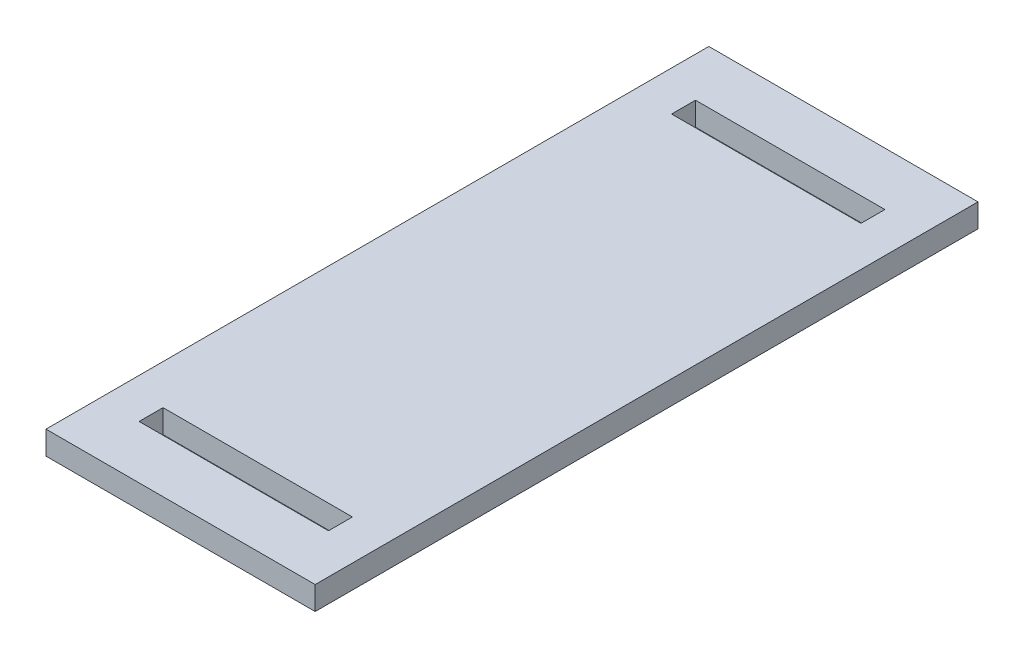
ISO-10303-21;
HEADER;
FILE_DESCRIPTION(('STEP AP214'),'2;1');
FILE_NAME('part.step','',(''),(''),'','','');
FILE_SCHEMA(('AUTOMOTIVE_DESIGN { 1 0 10303 214 1 1 1 1 }'));
ENDSEC;
DATA;
#1=APPLICATION_CONTEXT('core data for automotive mechanical design processes');
#2=APPLICATION_PROTOCOL_DEFINITION('international standard','automotive_design',2000,#1);
#3=PRODUCT_CONTEXT('',#1,'mechanical');
#4=PRODUCT('Part','Part','',(#3));
#5=PRODUCT_RELATED_PRODUCT_CATEGORY('part','',(#4));
#6=PRODUCT_DEFINITION_FORMATION('','',#4);
#7=PRODUCT_DEFINITION_CONTEXT('part definition',#1,'design');
#8=PRODUCT_DEFINITION('design','',#6,#7);
#9=PRODUCT_DEFINITION_SHAPE('','',#8);
#10=(LENGTH_UNIT() NAMED_UNIT(*) SI_UNIT(.MILLI.,.METRE.));
#11=(NAMED_UNIT(*) PLANE_ANGLE_UNIT() SI_UNIT($,.RADIAN.));
#12=(NAMED_UNIT(*) SI_UNIT($,.STERADIAN.) SOLID_ANGLE_UNIT());
#13=UNCERTAINTY_MEASURE_WITH_UNIT(LENGTH_MEASURE(1.E-05),#10,'distance_accuracy_value','');
#14=(GEOMETRIC_REPRESENTATION_CONTEXT(3) GLOBAL_UNCERTAINTY_ASSIGNED_CONTEXT((#13)) GLOBAL_UNIT_ASSIGNED_CONTEXT((#10,
#11,#12)) REPRESENTATION_CONTEXT('',''));
#15=CARTESIAN_POINT('',(0.,0.,0.));
#16=DIRECTION('',(0.,0.,1.));
#17=DIRECTION('',(1.,0.,0.));
#18=AXIS2_PLACEMENT_3D('',#15,#16,#17);
#19=CARTESIAN_POINT('',(0.,5.588,0.));
#20=DIRECTION('',(0.,1.,0.));
#21=DIRECTION('',(0.,0.,1.));
#22=AXIS2_PLACEMENT_3D('',#19,#20,#21);
#23=PLANE('',#22);
#24=DIRECTION('',(0.,0.,1.));
#25=VECTOR('',#24,1.);
#26=CARTESIAN_POINT('',(-32.131,5.588,-79.121));
#27=LINE('',#26,#25);
#28=CARTESIAN_POINT('',(-32.131,5.588,-79.121));
#29=VERTEX_POINT('',#28);
#30=CARTESIAN_POINT('',(-32.131,5.588,79.121));
#31=VERTEX_POINT('',#30);
#32=EDGE_CURVE('E191',#29,#31,#27,.T.);
#33=ORIENTED_EDGE('',*,*,#32,.T.);
#34=DIRECTION('',(1.,0.,0.));
#35=VECTOR('',#34,1.);
#36=CARTESIAN_POINT('',(-32.131,5.588,79.121));
#37=LINE('',#36,#35);
#38=CARTESIAN_POINT('',(32.131,5.588,79.121));
#39=VERTEX_POINT('',#38);
#40=EDGE_CURVE('E194',#31,#39,#37,.T.);
#41=ORIENTED_EDGE('',*,*,#40,.T.);
#42=DIRECTION('',(0.,0.,-1.));
#43=VECTOR('',#42,1.);
#44=CARTESIAN_POINT('',(32.131,5.588,-79.121));
#45=LINE('',#44,#43);
#46=CARTESIAN_POINT('',(32.131,5.588,-79.121));
#47=VERTEX_POINT('',#46);
#48=EDGE_CURVE('E197',#39,#47,#45,.T.);
#49=ORIENTED_EDGE('',*,*,#48,.T.);
#50=DIRECTION('',(-1.,0.,0.));
#51=VECTOR('',#50,1.);
#52=CARTESIAN_POINT('',(-32.131,5.588,-79.121));
#53=LINE('',#52,#51);
#54=EDGE_CURVE('E199',#47,#29,#53,.T.);
#55=ORIENTED_EDGE('',*,*,#54,.T.);
#56=EDGE_LOOP('',(#33,#41,#49,#55));
#57=FACE_BOUND('',#56,.T.);
#58=DIRECTION('',(1.,0.,0.));
#59=VECTOR('',#58,1.);
#60=CARTESIAN_POINT('',(-22.606,5.588,66.421));
#61=LINE('',#60,#59);
#62=CARTESIAN_POINT('',(-22.606,5.588,66.421));
#63=VERTEX_POINT('',#62);
#64=CARTESIAN_POINT('',(22.606,5.588,66.421));
#65=VERTEX_POINT('',#64);
#66=EDGE_CURVE('E162',#63,#65,#61,.T.);
#67=ORIENTED_EDGE('',*,*,#66,.F.);
#68=DIRECTION('',(0.,0.,1.));
#69=VECTOR('',#68,1.);
#70=CARTESIAN_POINT('',(-22.606,5.588,60.706));
#71=LINE('',#70,#69);
#72=CARTESIAN_POINT('',(-22.606,5.588,60.706));
#73=VERTEX_POINT('',#72);
#74=EDGE_CURVE('E160',#73,#63,#71,.T.);
#75=ORIENTED_EDGE('',*,*,#74,.F.);
#76=DIRECTION('',(-1.,0.,0.));
#77=VECTOR('',#76,1.);
#78=CARTESIAN_POINT('',(-22.606,5.588,60.706));
#79=LINE('',#78,#77);
#80=CARTESIAN_POINT('',(22.606,5.588,60.706));
#81=VERTEX_POINT('',#80);
#82=EDGE_CURVE('E168',#81,#73,#79,.T.);
#83=ORIENTED_EDGE('',*,*,#82,.F.);
#84=DIRECTION('',(0.,0.,-1.));
#85=VECTOR('',#84,1.);
#86=CARTESIAN_POINT('',(22.606,5.588,60.706));
#87=LINE('',#86,#85);
#88=EDGE_CURVE('E165',#65,#81,#87,.T.);
#89=ORIENTED_EDGE('',*,*,#88,.F.);
#90=EDGE_LOOP('',(#67,#75,#83,#89));
#91=FACE_BOUND('',#90,.T.);
#92=DIRECTION('',(1.,0.,0.));
#93=VECTOR('',#92,1.);
#94=CARTESIAN_POINT('',(-22.606,5.588,-60.706));
#95=LINE('',#94,#93);
#96=CARTESIAN_POINT('',(-22.606,5.588,-60.706));
#97=VERTEX_POINT('',#96);
#98=CARTESIAN_POINT('',(22.606,5.588,-60.706));
#99=VERTEX_POINT('',#98);
#100=EDGE_CURVE('E132',#97,#99,#95,.T.);
#101=ORIENTED_EDGE('',*,*,#100,.F.);
#102=DIRECTION('',(0.,0.,1.));
#103=VECTOR('',#102,1.);
#104=CARTESIAN_POINT('',(-22.606,5.588,-66.421));
#105=LINE('',#104,#103);
#106=CARTESIAN_POINT('',(-22.606,5.588,-66.421));
#107=VERTEX_POINT('',#106);
#108=EDGE_CURVE('E124',#107,#97,#105,.T.);
#109=ORIENTED_EDGE('',*,*,#108,.F.);
#110=DIRECTION('',(-1.,0.,0.));
#111=VECTOR('',#110,1.);
#112=CARTESIAN_POINT('',(-22.606,5.588,-66.421));
#113=LINE('',#112,#111);
#114=CARTESIAN_POINT('',(22.606,5.588,-66.421));
#115=VERTEX_POINT('',#114);
#116=EDGE_CURVE('E146',#115,#107,#113,.T.);
#117=ORIENTED_EDGE('',*,*,#116,.F.);
#118=DIRECTION('',(0.,0.,-1.));
#119=VECTOR('',#118,1.);
#120=CARTESIAN_POINT('',(22.606,5.588,-66.421));
#121=LINE('',#120,#119);
#122=EDGE_CURVE('E144',#99,#115,#121,.T.);
#123=ORIENTED_EDGE('',*,*,#122,.F.);
#124=EDGE_LOOP('',(#101,#109,#117,#123));
#125=FACE_BOUND('',#124,.T.);
#126=ADVANCED_FACE('F35',(#57,#91,#125),#23,.T.);
#127=CARTESIAN_POINT('',(0.,0.,0.));
#128=DIRECTION('',(0.,1.,0.));
#129=DIRECTION('',(0.,0.,1.));
#130=AXIS2_PLACEMENT_3D('',#127,#128,#129);
#131=PLANE('',#130);
#132=DIRECTION('',(0.,0.,1.));
#133=VECTOR('',#132,1.);
#134=CARTESIAN_POINT('',(-22.606,0.,60.706));
#135=LINE('',#134,#133);
#136=CARTESIAN_POINT('',(-22.606,0.,60.706));
#137=VERTEX_POINT('',#136);
#138=CARTESIAN_POINT('',(-22.606,0.,66.421));
#139=VERTEX_POINT('',#138);
#140=EDGE_CURVE('E140',#137,#139,#135,.T.);
#141=ORIENTED_EDGE('',*,*,#140,.T.);
#142=DIRECTION('',(1.,0.,0.));
#143=VECTOR('',#142,1.);
#144=CARTESIAN_POINT('',(-22.606,0.,66.421));
#145=LINE('',#144,#143);
#146=CARTESIAN_POINT('',(22.606,0.,66.421));
#147=VERTEX_POINT('',#146);
#148=EDGE_CURVE('E173',#139,#147,#145,.T.);
#149=ORIENTED_EDGE('',*,*,#148,.T.);
#150=DIRECTION('',(0.,0.,-1.));
#151=VECTOR('',#150,1.);
#152=CARTESIAN_POINT('',(22.606,0.,60.706));
#153=LINE('',#152,#151);
#154=CARTESIAN_POINT('',(22.606,0.,60.706));
#155=VERTEX_POINT('',#154);
#156=EDGE_CURVE('E176',#147,#155,#153,.T.);
#157=ORIENTED_EDGE('',*,*,#156,.T.);
#158=DIRECTION('',(-1.,0.,0.));
#159=VECTOR('',#158,1.);
#160=CARTESIAN_POINT('',(-22.606,0.,60.706));
#161=LINE('',#160,#159);
#162=EDGE_CURVE('E163',#155,#137,#161,.T.);
#163=ORIENTED_EDGE('',*,*,#162,.T.);
#164=EDGE_LOOP('',(#141,#149,#157,#163));
#165=FACE_BOUND('',#164,.T.);
#166=DIRECTION('',(0.,0.,1.));
#167=VECTOR('',#166,1.);
#168=CARTESIAN_POINT('',(-32.131,0.,-79.121));
#169=LINE('',#168,#167);
#170=CARTESIAN_POINT('',(-32.131,0.,-79.121));
#171=VERTEX_POINT('',#170);
#172=CARTESIAN_POINT('',(-32.131,0.,79.121));
#173=VERTEX_POINT('',#172);
#174=EDGE_CURVE('E190',#171,#173,#169,.T.);
#175=ORIENTED_EDGE('',*,*,#174,.F.);
#176=DIRECTION('',(-1.,0.,0.));
#177=VECTOR('',#176,1.);
#178=CARTESIAN_POINT('',(-32.131,0.,-79.121));
#179=LINE('',#178,#177);
#180=CARTESIAN_POINT('',(32.131,0.,-79.121));
#181=VERTEX_POINT('',#180);
#182=EDGE_CURVE('E195',#181,#171,#179,.T.);
#183=ORIENTED_EDGE('',*,*,#182,.F.);
#184=DIRECTION('',(0.,0.,-1.));
#185=VECTOR('',#184,1.);
#186=CARTESIAN_POINT('',(32.131,0.,-79.121));
#187=LINE('',#186,#185);
#188=CARTESIAN_POINT('',(32.131,0.,79.121));
#189=VERTEX_POINT('',#188);
#190=EDGE_CURVE('E206',#189,#181,#187,.T.);
#191=ORIENTED_EDGE('',*,*,#190,.F.);
#192=DIRECTION('',(1.,0.,0.));
#193=VECTOR('',#192,1.);
#194=CARTESIAN_POINT('',(-32.131,0.,79.121));
#195=LINE('',#194,#193);
#196=EDGE_CURVE('E204',#173,#189,#195,.T.);
#197=ORIENTED_EDGE('',*,*,#196,.F.);
#198=EDGE_LOOP('',(#175,#183,#191,#197));
#199=FACE_BOUND('',#198,.T.);
#200=DIRECTION('',(0.,0.,1.));
#201=VECTOR('',#200,1.);
#202=CARTESIAN_POINT('',(-22.606,0.,-66.421));
#203=LINE('',#202,#201);
#204=CARTESIAN_POINT('',(-22.606,0.,-66.421));
#205=VERTEX_POINT('',#204);
#206=CARTESIAN_POINT('',(-22.606,0.,-60.706));
#207=VERTEX_POINT('',#206);
#208=EDGE_CURVE('E58',#205,#207,#203,.T.);
#209=ORIENTED_EDGE('',*,*,#208,.T.);
#210=DIRECTION('',(1.,0.,0.));
#211=VECTOR('',#210,1.);
#212=CARTESIAN_POINT('',(-22.606,0.,-60.706));
#213=LINE('',#212,#211);
#214=CARTESIAN_POINT('',(22.606,0.,-60.706));
#215=VERTEX_POINT('',#214);
#216=EDGE_CURVE('E139',#207,#215,#213,.T.);
#217=ORIENTED_EDGE('',*,*,#216,.T.);
#218=DIRECTION('',(0.,0.,-1.));
#219=VECTOR('',#218,1.);
#220=CARTESIAN_POINT('',(22.606,0.,-66.421));
#221=LINE('',#220,#219);
#222=CARTESIAN_POINT('',(22.606,0.,-66.421));
#223=VERTEX_POINT('',#222);
#224=EDGE_CURVE('E152',#215,#223,#221,.T.);
#225=ORIENTED_EDGE('',*,*,#224,.T.);
#226=DIRECTION('',(-1.,0.,0.));
#227=VECTOR('',#226,1.);
#228=CARTESIAN_POINT('',(-22.606,0.,-66.421));
#229=LINE('',#228,#227);
#230=EDGE_CURVE('E133',#223,#205,#229,.T.);
#231=ORIENTED_EDGE('',*,*,#230,.T.);
#232=EDGE_LOOP('',(#209,#217,#225,#231));
#233=FACE_BOUND('',#232,.T.);
#234=ADVANCED_FACE('F224',(#165,#199,#233),#131,.F.);
#235=CARTESIAN_POINT('',(-32.131,5.588,-79.121));
#236=DIRECTION('',(1.,0.,0.));
#237=DIRECTION('',(0.,0.,-1.));
#238=AXIS2_PLACEMENT_3D('',#235,#236,#237);
#239=PLANE('',#238);
#240=ORIENTED_EDGE('',*,*,#174,.T.);
#241=DIRECTION('',(0.,-1.,0.));
#242=VECTOR('',#241,1.);
#243=CARTESIAN_POINT('',(-32.131,5.588,79.121));
#244=LINE('',#243,#242);
#245=EDGE_CURVE('E11',#31,#173,#244,.T.);
#246=ORIENTED_EDGE('',*,*,#245,.F.);
#247=ORIENTED_EDGE('',*,*,#32,.F.);
#248=DIRECTION('',(0.,-1.,0.));
#249=VECTOR('',#248,1.);
#250=CARTESIAN_POINT('',(-32.131,5.588,-79.121));
#251=LINE('',#250,#249);
#252=EDGE_CURVE('E201',#29,#171,#251,.T.);
#253=ORIENTED_EDGE('',*,*,#252,.T.);
#254=EDGE_LOOP('',(#240,#246,#247,#253));
#255=FACE_BOUND('',#254,.T.);
#256=ADVANCED_FACE('F37',(#255),#239,.F.);
#257=CARTESIAN_POINT('',(-32.131,5.588,79.121));
#258=DIRECTION('',(0.,0.,-1.));
#259=DIRECTION('',(-1.,0.,0.));
#260=AXIS2_PLACEMENT_3D('',#257,#258,#259);
#261=PLANE('',#260);
#262=ORIENTED_EDGE('',*,*,#196,.T.);
#263=DIRECTION('',(0.,-1.,0.));
#264=VECTOR('',#263,1.);
#265=CARTESIAN_POINT('',(32.131,5.588,79.121));
#266=LINE('',#265,#264);
#267=EDGE_CURVE('E43',#39,#189,#266,.T.);
#268=ORIENTED_EDGE('',*,*,#267,.F.);
#269=ORIENTED_EDGE('',*,*,#40,.F.);
#270=ORIENTED_EDGE('',*,*,#245,.T.);
#271=EDGE_LOOP('',(#262,#268,#269,#270));
#272=FACE_BOUND('',#271,.T.);
#273=ADVANCED_FACE('F235',(#272),#261,.F.);
#274=CARTESIAN_POINT('',(32.131,5.588,-79.121));
#275=DIRECTION('',(-1.,0.,0.));
#276=DIRECTION('',(0.,0.,1.));
#277=AXIS2_PLACEMENT_3D('',#274,#275,#276);
#278=PLANE('',#277);
#279=ORIENTED_EDGE('',*,*,#190,.T.);
#280=DIRECTION('',(0.,-1.,0.));
#281=VECTOR('',#280,1.);
#282=CARTESIAN_POINT('',(32.131,5.588,-79.121));
#283=LINE('',#282,#281);
#284=EDGE_CURVE('E211',#47,#181,#283,.T.);
#285=ORIENTED_EDGE('',*,*,#284,.F.);
#286=ORIENTED_EDGE('',*,*,#48,.F.);
#287=ORIENTED_EDGE('',*,*,#267,.T.);
#288=EDGE_LOOP('',(#279,#285,#286,#287));
#289=FACE_BOUND('',#288,.T.);
#290=ADVANCED_FACE('F218',(#289),#278,.F.);
#291=CARTESIAN_POINT('',(-32.131,5.588,-79.121));
#292=DIRECTION('',(0.,0.,1.));
#293=DIRECTION('',(1.,0.,0.));
#294=AXIS2_PLACEMENT_3D('',#291,#292,#293);
#295=PLANE('',#294);
#296=ORIENTED_EDGE('',*,*,#182,.T.);
#297=ORIENTED_EDGE('',*,*,#252,.F.);
#298=ORIENTED_EDGE('',*,*,#54,.F.);
#299=ORIENTED_EDGE('',*,*,#284,.T.);
#300=EDGE_LOOP('',(#296,#297,#298,#299));
#301=FACE_BOUND('',#300,.T.);
#302=ADVANCED_FACE('F228',(#301),#295,.F.);
#303=CARTESIAN_POINT('',(-22.606,5.588,60.706));
#304=DIRECTION('',(1.,0.,0.));
#305=DIRECTION('',(0.,0.,-1.));
#306=AXIS2_PLACEMENT_3D('',#303,#304,#305);
#307=PLANE('',#306);
#308=ORIENTED_EDGE('',*,*,#140,.F.);
#309=DIRECTION('',(0.,-1.,0.));
#310=VECTOR('',#309,1.);
#311=CARTESIAN_POINT('',(-22.606,5.588,60.706));
#312=LINE('',#311,#310);
#313=EDGE_CURVE('E170',#73,#137,#312,.T.);
#314=ORIENTED_EDGE('',*,*,#313,.F.);
#315=ORIENTED_EDGE('',*,*,#74,.T.);
#316=DIRECTION('',(0.,-1.,0.));
#317=VECTOR('',#316,1.);
#318=CARTESIAN_POINT('',(-22.606,5.588,66.421));
#319=LINE('',#318,#317);
#320=EDGE_CURVE('E187',#63,#139,#319,.T.);
#321=ORIENTED_EDGE('',*,*,#320,.T.);
#322=EDGE_LOOP('',(#308,#314,#315,#321));
#323=FACE_BOUND('',#322,.T.);
#324=ADVANCED_FACE('F250',(#323),#307,.T.);
#325=CARTESIAN_POINT('',(-22.606,5.588,66.421));
#326=DIRECTION('',(0.,0.,-1.));
#327=DIRECTION('',(-1.,0.,0.));
#328=AXIS2_PLACEMENT_3D('',#325,#326,#327);
#329=PLANE('',#328);
#330=ORIENTED_EDGE('',*,*,#148,.F.);
#331=ORIENTED_EDGE('',*,*,#320,.F.);
#332=ORIENTED_EDGE('',*,*,#66,.T.);
#333=DIRECTION('',(0.,-1.,0.));
#334=VECTOR('',#333,1.);
#335=CARTESIAN_POINT('',(22.606,5.588,66.421));
#336=LINE('',#335,#334);
#337=EDGE_CURVE('E185',#65,#147,#336,.T.);
#338=ORIENTED_EDGE('',*,*,#337,.T.);
#339=EDGE_LOOP('',(#330,#331,#332,#338));
#340=FACE_BOUND('',#339,.T.);
#341=ADVANCED_FACE('F257',(#340),#329,.T.);
#342=CARTESIAN_POINT('',(22.606,5.588,60.706));
#343=DIRECTION('',(-1.,0.,0.));
#344=DIRECTION('',(0.,0.,1.));
#345=AXIS2_PLACEMENT_3D('',#342,#343,#344);
#346=PLANE('',#345);
#347=ORIENTED_EDGE('',*,*,#156,.F.);
#348=ORIENTED_EDGE('',*,*,#337,.F.);
#349=ORIENTED_EDGE('',*,*,#88,.T.);
#350=DIRECTION('',(0.,-1.,0.));
#351=VECTOR('',#350,1.);
#352=CARTESIAN_POINT('',(22.606,5.588,60.706));
#353=LINE('',#352,#351);
#354=EDGE_CURVE('E183',#81,#155,#353,.T.);
#355=ORIENTED_EDGE('',*,*,#354,.T.);
#356=EDGE_LOOP('',(#347,#348,#349,#355));
#357=FACE_BOUND('',#356,.T.);
#358=ADVANCED_FACE('F262',(#357),#346,.T.);
#359=CARTESIAN_POINT('',(-22.606,5.588,60.706));
#360=DIRECTION('',(0.,0.,1.));
#361=DIRECTION('',(1.,0.,0.));
#362=AXIS2_PLACEMENT_3D('',#359,#360,#361);
#363=PLANE('',#362);
#364=ORIENTED_EDGE('',*,*,#162,.F.);
#365=ORIENTED_EDGE('',*,*,#354,.F.);
#366=ORIENTED_EDGE('',*,*,#82,.T.);
#367=ORIENTED_EDGE('',*,*,#313,.T.);
#368=EDGE_LOOP('',(#364,#365,#366,#367));
#369=FACE_BOUND('',#368,.T.);
#370=ADVANCED_FACE('F269',(#369),#363,.T.);
#371=CARTESIAN_POINT('',(-22.606,5.588,-66.421));
#372=DIRECTION('',(1.,0.,0.));
#373=DIRECTION('',(0.,0.,-1.));
#374=AXIS2_PLACEMENT_3D('',#371,#372,#373);
#375=PLANE('',#374);
#376=ORIENTED_EDGE('',*,*,#208,.F.);
#377=DIRECTION('',(0.,-1.,0.));
#378=VECTOR('',#377,1.);
#379=CARTESIAN_POINT('',(-22.606,5.588,-66.421));
#380=LINE('',#379,#378);
#381=EDGE_CURVE('E128',#107,#205,#380,.T.);
#382=ORIENTED_EDGE('',*,*,#381,.F.);
#383=ORIENTED_EDGE('',*,*,#108,.T.);
#384=DIRECTION('',(0.,-1.,0.));
#385=VECTOR('',#384,1.);
#386=CARTESIAN_POINT('',(-22.606,5.588,-60.706));
#387=LINE('',#386,#385);
#388=EDGE_CURVE('E127',#97,#207,#387,.T.);
#389=ORIENTED_EDGE('',*,*,#388,.T.);
#390=EDGE_LOOP('',(#376,#382,#383,#389));
#391=FACE_BOUND('',#390,.T.);
#392=ADVANCED_FACE('F126',(#391),#375,.T.);
#393=CARTESIAN_POINT('',(-22.606,5.588,-60.706));
#394=DIRECTION('',(0.,0.,-1.));
#395=DIRECTION('',(-1.,0.,0.));
#396=AXIS2_PLACEMENT_3D('',#393,#394,#395);
#397=PLANE('',#396);
#398=ORIENTED_EDGE('',*,*,#216,.F.);
#399=ORIENTED_EDGE('',*,*,#388,.F.);
#400=ORIENTED_EDGE('',*,*,#100,.T.);
#401=DIRECTION('',(0.,-1.,0.));
#402=VECTOR('',#401,1.);
#403=CARTESIAN_POINT('',(22.606,5.588,-60.706));
#404=LINE('',#403,#402);
#405=EDGE_CURVE('E141',#99,#215,#404,.T.);
#406=ORIENTED_EDGE('',*,*,#405,.T.);
#407=EDGE_LOOP('',(#398,#399,#400,#406));
#408=FACE_BOUND('',#407,.T.);
#409=ADVANCED_FACE('F136',(#408),#397,.T.);
#410=CARTESIAN_POINT('',(22.606,5.588,-66.421));
#411=DIRECTION('',(-1.,0.,0.));
#412=DIRECTION('',(0.,0.,1.));
#413=AXIS2_PLACEMENT_3D('',#410,#411,#412);
#414=PLANE('',#413);
#415=ORIENTED_EDGE('',*,*,#224,.F.);
#416=ORIENTED_EDGE('',*,*,#405,.F.);
#417=ORIENTED_EDGE('',*,*,#122,.T.);
#418=DIRECTION('',(0.,-1.,0.));
#419=VECTOR('',#418,1.);
#420=CARTESIAN_POINT('',(22.606,5.588,-66.421));
#421=LINE('',#420,#419);
#422=EDGE_CURVE('E50',#115,#223,#421,.T.);
#423=ORIENTED_EDGE('',*,*,#422,.T.);
#424=EDGE_LOOP('',(#415,#416,#417,#423));
#425=FACE_BOUND('',#424,.T.);
#426=ADVANCED_FACE('F287',(#425),#414,.T.);
#427=CARTESIAN_POINT('',(-22.606,5.588,-66.421));
#428=DIRECTION('',(0.,0.,1.));
#429=DIRECTION('',(1.,0.,0.));
#430=AXIS2_PLACEMENT_3D('',#427,#428,#429);
#431=PLANE('',#430);
#432=ORIENTED_EDGE('',*,*,#230,.F.);
#433=ORIENTED_EDGE('',*,*,#422,.F.);
#434=ORIENTED_EDGE('',*,*,#116,.T.);
#435=ORIENTED_EDGE('',*,*,#381,.T.);
#436=EDGE_LOOP('',(#432,#433,#434,#435));
#437=FACE_BOUND('',#436,.T.);
#438=ADVANCED_FACE('F290',(#437),#431,.T.);
#439=CLOSED_SHELL('',(#126,#234,#256,#273,#290,#302,#324,#341,#358,#370,#392,#409,#426,#438));
#440=MANIFOLD_SOLID_BREP('B2',#439);
#441=ADVANCED_BREP_SHAPE_REPRESENTATION('',(#18,#440),#14);
#442=SHAPE_DEFINITION_REPRESENTATION(#9,#441);
ENDSEC;
END-ISO-10303-21;
